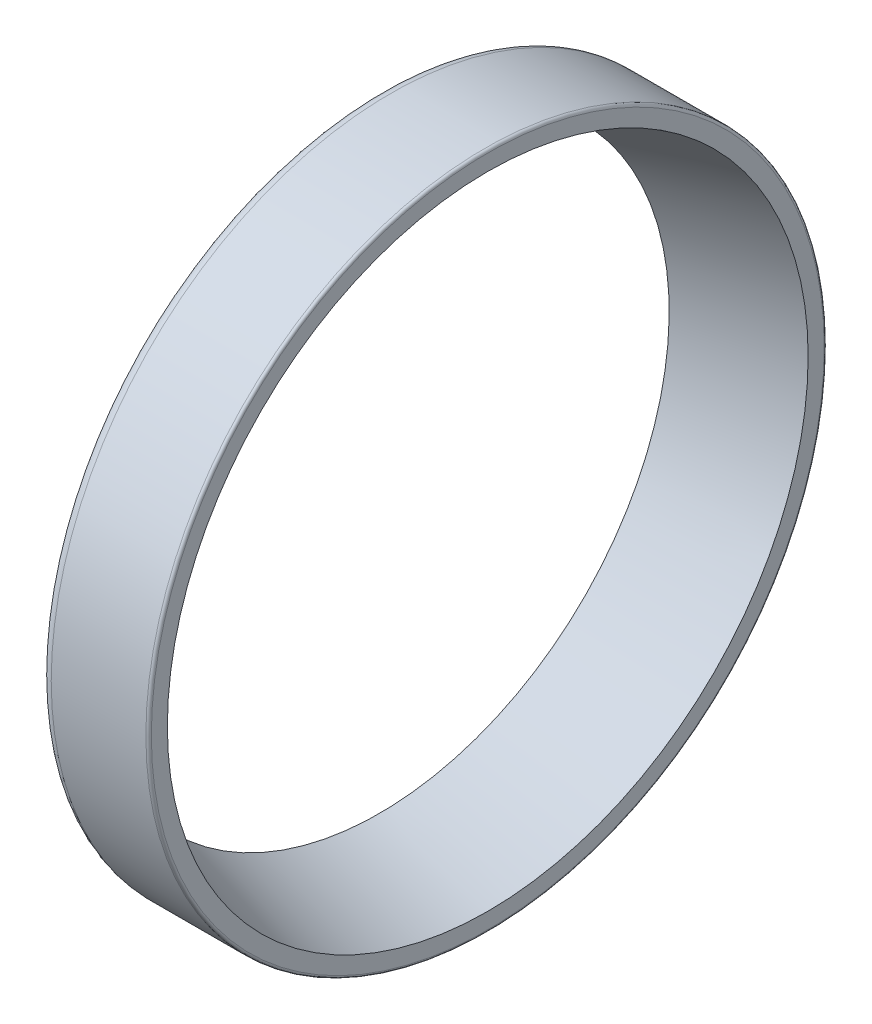
ISO-10303-21;
HEADER;
FILE_DESCRIPTION(('STEP AP214'),'2;1');
FILE_NAME('part.step','',(''),(''),'','','');
FILE_SCHEMA(('AUTOMOTIVE_DESIGN { 1 0 10303 214 1 1 1 1 }'));
ENDSEC;
DATA;
#1=APPLICATION_CONTEXT('core data for automotive mechanical design processes');
#2=APPLICATION_PROTOCOL_DEFINITION('international standard','automotive_design',2000,#1);
#3=PRODUCT_CONTEXT('',#1,'mechanical');
#4=PRODUCT('Part','Part','',(#3));
#5=PRODUCT_RELATED_PRODUCT_CATEGORY('part','',(#4));
#6=PRODUCT_DEFINITION_FORMATION('','',#4);
#7=PRODUCT_DEFINITION_CONTEXT('part definition',#1,'design');
#8=PRODUCT_DEFINITION('design','',#6,#7);
#9=PRODUCT_DEFINITION_SHAPE('','',#8);
#10=(LENGTH_UNIT() NAMED_UNIT(*) SI_UNIT(.MILLI.,.METRE.));
#11=(NAMED_UNIT(*) PLANE_ANGLE_UNIT() SI_UNIT($,.RADIAN.));
#12=(NAMED_UNIT(*) SI_UNIT($,.STERADIAN.) SOLID_ANGLE_UNIT());
#13=UNCERTAINTY_MEASURE_WITH_UNIT(LENGTH_MEASURE(1.E-05),#10,'distance_accuracy_value','');
#14=(GEOMETRIC_REPRESENTATION_CONTEXT(3) GLOBAL_UNCERTAINTY_ASSIGNED_CONTEXT((#13)) GLOBAL_UNIT_ASSIGNED_CONTEXT((#10,
#11,#12)) REPRESENTATION_CONTEXT('',''));
#15=CARTESIAN_POINT('',(0.,0.,0.));
#16=DIRECTION('',(0.,0.,1.));
#17=DIRECTION('',(1.,0.,0.));
#18=AXIS2_PLACEMENT_3D('',#15,#16,#17);
#19=CARTESIAN_POINT('',(8.11276,0.,0.));
#20=DIRECTION('',(-1.,0.,0.));
#21=DIRECTION('',(0.,0.,1.));
#22=AXIS2_PLACEMENT_3D('',#19,#20,#21);
#23=CYLINDRICAL_SURFACE('',#22,47.22876);
#24=CARTESIAN_POINT('',(14.70152,0.,0.));
#25=DIRECTION('',(1.,0.,0.));
#26=DIRECTION('',(0.,0.,-1.));
#27=AXIS2_PLACEMENT_3D('',#24,#25,#26);
#28=CIRCLE('',#27,47.22876);
#29=CARTESIAN_POINT('',(14.70152,0.,-47.22876));
#30=VERTEX_POINT('',#29);
#31=EDGE_CURVE('E31',#30,#30,#28,.T.);
#32=ORIENTED_EDGE('',*,*,#31,.F.);
#33=EDGE_LOOP('',(#32));
#34=FACE_BOUND('',#33,.T.);
#35=CARTESIAN_POINT('',(1.52400000000001,0.,0.));
#36=DIRECTION('',(-1.,0.,0.));
#37=DIRECTION('',(0.,0.,1.));
#38=AXIS2_PLACEMENT_3D('',#35,#36,#37);
#39=CIRCLE('',#38,47.22876);
#40=CARTESIAN_POINT('',(1.52400000000001,0.,47.22876));
#41=VERTEX_POINT('',#40);
#42=EDGE_CURVE('E37',#41,#41,#39,.T.);
#43=ORIENTED_EDGE('',*,*,#42,.F.);
#44=EDGE_LOOP('',(#43));
#45=FACE_BOUND('',#44,.T.);
#46=ADVANCED_FACE('F15',(#34,#45),#23,.T.);
#47=CARTESIAN_POINT('',(14.70152,0.,0.));
#48=DIRECTION('',(-1.,0.,0.));
#49=DIRECTION('',(0.,0.,1.));
#50=AXIS2_PLACEMENT_3D('',#47,#48,#49);
#51=TOROIDAL_SURFACE('',#50,46.84776,0.381000000000005);
#52=ORIENTED_EDGE('',*,*,#31,.T.);
#53=EDGE_LOOP('',(#52));
#54=FACE_BOUND('',#53,.T.);
#55=CARTESIAN_POINT('',(15.08252,0.,0.));
#56=DIRECTION('',(-1.,0.,0.));
#57=DIRECTION('',(0.,0.,1.));
#58=AXIS2_PLACEMENT_3D('',#55,#56,#57);
#59=CIRCLE('',#58,46.84776);
#60=CARTESIAN_POINT('',(15.08252,0.,46.84776));
#61=VERTEX_POINT('',#60);
#62=EDGE_CURVE('E19',#61,#61,#59,.F.);
#63=ORIENTED_EDGE('',*,*,#62,.F.);
#64=EDGE_LOOP('',(#63));
#65=FACE_BOUND('',#64,.T.);
#66=ADVANCED_FACE('F46',(#54,#65),#51,.T.);
#67=CARTESIAN_POINT('',(1.52400000000001,0.,0.));
#68=DIRECTION('',(-1.,0.,0.));
#69=DIRECTION('',(0.,0.,1.));
#70=AXIS2_PLACEMENT_3D('',#67,#68,#69);
#71=TOROIDAL_SURFACE('',#70,45.70476,1.524);
#72=ORIENTED_EDGE('',*,*,#42,.T.);
#73=EDGE_LOOP('',(#72));
#74=FACE_BOUND('',#73,.T.);
#75=CARTESIAN_POINT('',(0.,0.,0.));
#76=DIRECTION('',(-1.,0.,0.));
#77=DIRECTION('',(0.,0.,1.));
#78=AXIS2_PLACEMENT_3D('',#75,#76,#77);
#79=CIRCLE('',#78,45.70476);
#80=CARTESIAN_POINT('',(0.,0.,45.70476));
#81=VERTEX_POINT('',#80);
#82=EDGE_CURVE('E28',#81,#81,#79,.T.);
#83=ORIENTED_EDGE('',*,*,#82,.F.);
#84=EDGE_LOOP('',(#83));
#85=FACE_BOUND('',#84,.T.);
#86=ADVANCED_FACE('F17',(#74,#85),#71,.T.);
#87=CARTESIAN_POINT('',(15.08252,0.,45.731408234617));
#88=DIRECTION('',(1.,0.,0.));
#89=DIRECTION('',(0.,0.,-1.));
#90=AXIS2_PLACEMENT_3D('',#87,#88,#89);
#91=PLANE('',#90);
#92=ORIENTED_EDGE('',*,*,#62,.T.);
#93=EDGE_LOOP('',(#92));
#94=FACE_BOUND('',#93,.T.);
#95=CARTESIAN_POINT('',(15.08252,0.,0.));
#96=DIRECTION('',(1.,0.,0.));
#97=DIRECTION('',(0.,1.,0.));
#98=AXIS2_PLACEMENT_3D('',#95,#96,#97);
#99=CIRCLE('',#98,44.6150564692339);
#100=CARTESIAN_POINT('',(15.08252,44.6150564692339,0.));
#101=VERTEX_POINT('',#100);
#102=EDGE_CURVE('E23',#101,#101,#99,.F.);
#103=ORIENTED_EDGE('',*,*,#102,.T.);
#104=EDGE_LOOP('',(#103));
#105=FACE_BOUND('',#104,.T.);
#106=ADVANCED_FACE('F65',(#94,#105),#91,.T.);
#107=CARTESIAN_POINT('',(0.,0.,43.0259218977863));
#108=DIRECTION('',(-1.,0.,0.));
#109=DIRECTION('',(0.,0.,1.));
#110=AXIS2_PLACEMENT_3D('',#107,#108,#109);
#111=PLANE('',#110);
#112=CARTESIAN_POINT('',(0.,0.,0.));
#113=DIRECTION('',(1.,0.,0.));
#114=DIRECTION('',(0.,1.,0.));
#115=AXIS2_PLACEMENT_3D('',#112,#113,#114);
#116=CIRCLE('',#115,40.3470837955725);
#117=CARTESIAN_POINT('',(0.,40.3470837955725,0.));
#118=VERTEX_POINT('',#117);
#119=EDGE_CURVE('E10',#118,#118,#116,.T.);
#120=ORIENTED_EDGE('',*,*,#119,.T.);
#121=EDGE_LOOP('',(#120));
#122=FACE_BOUND('',#121,.T.);
#123=ORIENTED_EDGE('',*,*,#82,.T.);
#124=EDGE_LOOP('',(#123));
#125=FACE_BOUND('',#124,.T.);
#126=ADVANCED_FACE('F59',(#122,#125),#111,.T.);
#127=CARTESIAN_POINT('',(15.08252,0.,0.));
#128=DIRECTION('',(1.,0.,0.));
#129=DIRECTION('',(0.,1.,0.));
#130=AXIS2_PLACEMENT_3D('',#127,#128,#129);
#131=CONICAL_SURFACE('',#130,44.6150564692339,0.27576507327514);
#132=ORIENTED_EDGE('',*,*,#102,.F.);
#133=EDGE_LOOP('',(#132));
#134=FACE_BOUND('',#133,.T.);
#135=ORIENTED_EDGE('',*,*,#119,.F.);
#136=EDGE_LOOP('',(#135));
#137=FACE_BOUND('',#136,.T.);
#138=ADVANCED_FACE('F57',(#134,#137),#131,.F.);
#139=CLOSED_SHELL('',(#46,#66,#86,#106,#126,#138));
#140=MANIFOLD_SOLID_BREP('B1',#139);
#141=ADVANCED_BREP_SHAPE_REPRESENTATION('',(#18,#140),#14);
#142=SHAPE_DEFINITION_REPRESENTATION(#9,#141);
ENDSEC;
END-ISO-10303-21;
